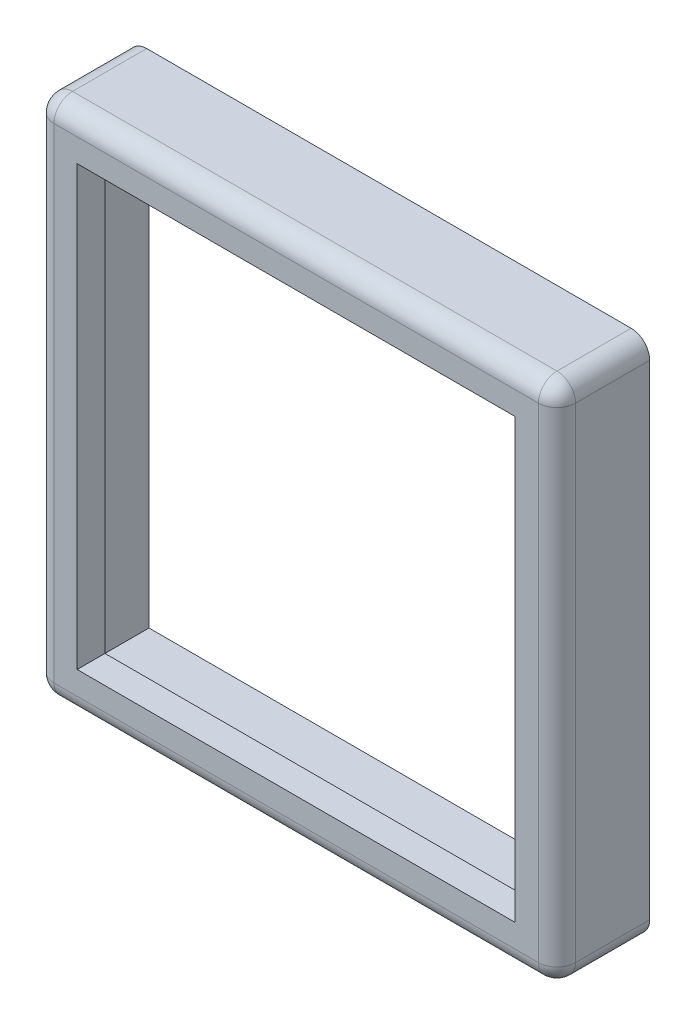
ISO-10303-21;
HEADER;
FILE_DESCRIPTION(('STEP AP214'),'2;1');
FILE_NAME('part.step','',(''),(''),'','','');
FILE_SCHEMA(('AUTOMOTIVE_DESIGN { 1 0 10303 214 1 1 1 1 }'));
ENDSEC;
DATA;
#1=APPLICATION_CONTEXT('core data for automotive mechanical design processes');
#2=APPLICATION_PROTOCOL_DEFINITION('international standard','automotive_design',2000,#1);
#3=PRODUCT_CONTEXT('',#1,'mechanical');
#4=PRODUCT('Part','Part','',(#3));
#5=PRODUCT_RELATED_PRODUCT_CATEGORY('part','',(#4));
#6=PRODUCT_DEFINITION_FORMATION('','',#4);
#7=PRODUCT_DEFINITION_CONTEXT('part definition',#1,'design');
#8=PRODUCT_DEFINITION('design','',#6,#7);
#9=PRODUCT_DEFINITION_SHAPE('','',#8);
#10=(LENGTH_UNIT() NAMED_UNIT(*) SI_UNIT(.MILLI.,.METRE.));
#11=(NAMED_UNIT(*) PLANE_ANGLE_UNIT() SI_UNIT($,.RADIAN.));
#12=(NAMED_UNIT(*) SI_UNIT($,.STERADIAN.) SOLID_ANGLE_UNIT());
#13=UNCERTAINTY_MEASURE_WITH_UNIT(LENGTH_MEASURE(1.E-05),#10,'distance_accuracy_value','');
#14=(GEOMETRIC_REPRESENTATION_CONTEXT(3) GLOBAL_UNCERTAINTY_ASSIGNED_CONTEXT((#13)) GLOBAL_UNIT_ASSIGNED_CONTEXT((#10,
#11,#12)) REPRESENTATION_CONTEXT('',''));
#15=CARTESIAN_POINT('',(0.,0.,0.));
#16=DIRECTION('',(0.,0.,1.));
#17=DIRECTION('',(1.,0.,0.));
#18=AXIS2_PLACEMENT_3D('',#15,#16,#17);
#19=CARTESIAN_POINT('',(5.55624999999943,-113.506249999997,-2.53999999999976));
#20=DIRECTION('',(0.,-1.,0.));
#21=DIRECTION('',(0.,0.,-1.));
#22=AXIS2_PLACEMENT_3D('',#19,#20,#21);
#23=PLANE('',#22);
#24=DIRECTION('',(1.,0.,0.));
#25=VECTOR('',#24,1.);
#26=CARTESIAN_POINT('',(5.55624999999943,-113.506249999997,-0.507999999999953));
#27=LINE('',#26,#25);
#28=CARTESIAN_POINT('',(19.3357499999994,-113.506249999997,-0.507999999999953));
#29=VERTEX_POINT('',#28);
#30=CARTESIAN_POINT('',(6.06424999999944,-113.506249999997,-0.507999999999953));
#31=VERTEX_POINT('',#30);
#32=EDGE_CURVE('E264',#29,#31,#27,.F.);
#33=ORIENTED_EDGE('',*,*,#32,.T.);
#34=DIRECTION('',(0.,0.,1.));
#35=VECTOR('',#34,1.);
#36=CARTESIAN_POINT('',(6.06424999999944,-113.506249999997,-2.53999999999976));
#37=LINE('',#36,#35);
#38=CARTESIAN_POINT('',(6.06424999999944,-113.506249999997,-2.53999999999976));
#39=VERTEX_POINT('',#38);
#40=EDGE_CURVE('E267',#31,#39,#37,.F.);
#41=ORIENTED_EDGE('',*,*,#40,.T.);
#42=DIRECTION('',(1.,0.,0.));
#43=VECTOR('',#42,1.);
#44=CARTESIAN_POINT('',(5.55624999999943,-113.506249999997,-2.53999999999976));
#45=LINE('',#44,#43);
#46=CARTESIAN_POINT('',(19.3357499999994,-113.506249999997,-2.53999999999976));
#47=VERTEX_POINT('',#46);
#48=EDGE_CURVE('E234',#39,#47,#45,.T.);
#49=ORIENTED_EDGE('',*,*,#48,.T.);
#50=DIRECTION('',(0.,0.,1.));
#51=VECTOR('',#50,1.);
#52=CARTESIAN_POINT('',(19.3357499999994,-113.506249999997,-2.53999999999976));
#53=LINE('',#52,#51);
#54=EDGE_CURVE('E262',#47,#29,#53,.T.);
#55=ORIENTED_EDGE('',*,*,#54,.T.);
#56=EDGE_LOOP('',(#33,#41,#49,#55));
#57=FACE_BOUND('',#56,.T.);
#58=ADVANCED_FACE('F44',(#57),#23,.T.);
#59=CARTESIAN_POINT('',(5.55624999999943,-99.2187499999968,-2.53999999999976));
#60=DIRECTION('',(-1.,0.,0.));
#61=DIRECTION('',(0.,-1.,0.));
#62=AXIS2_PLACEMENT_3D('',#59,#60,#61);
#63=PLANE('',#62);
#64=DIRECTION('',(0.,-1.,0.));
#65=VECTOR('',#64,1.);
#66=CARTESIAN_POINT('',(5.55624999999943,-99.2187499999968,-0.507999999999065));
#67=LINE('',#66,#65);
#68=CARTESIAN_POINT('',(5.55624999999943,-112.998249999998,-0.507999999997288));
#69=VERTEX_POINT('',#68);
#70=CARTESIAN_POINT('',(5.55624999999943,-99.7267499999968,-0.507999999999953));
#71=VERTEX_POINT('',#70);
#72=EDGE_CURVE('E271',#69,#71,#67,.F.);
#73=ORIENTED_EDGE('',*,*,#72,.T.);
#74=DIRECTION('',(0.,0.,1.));
#75=VECTOR('',#74,1.);
#76=CARTESIAN_POINT('',(5.55624999999943,-99.7267499999968,-2.53999999999976));
#77=LINE('',#76,#75);
#78=CARTESIAN_POINT('',(5.55624999999943,-99.7267499999968,-2.53999999999976));
#79=VERTEX_POINT('',#78);
#80=EDGE_CURVE('E273',#71,#79,#77,.F.);
#81=ORIENTED_EDGE('',*,*,#80,.T.);
#82=DIRECTION('',(0.,-1.,0.));
#83=VECTOR('',#82,1.);
#84=CARTESIAN_POINT('',(5.55624999999943,-99.2187499999968,-2.53999999999976));
#85=LINE('',#84,#83);
#86=CARTESIAN_POINT('',(5.55624999999943,-112.998249999996,-2.54000000000243));
#87=VERTEX_POINT('',#86);
#88=EDGE_CURVE('E247',#79,#87,#85,.T.);
#89=ORIENTED_EDGE('',*,*,#88,.T.);
#90=DIRECTION('',(0.,0.,1.));
#91=VECTOR('',#90,1.);
#92=CARTESIAN_POINT('',(5.55624999999943,-112.998249999996,-2.54000000000243));
#93=LINE('',#92,#91);
#94=EDGE_CURVE('E269',#87,#69,#93,.T.);
#95=ORIENTED_EDGE('',*,*,#94,.T.);
#96=EDGE_LOOP('',(#73,#81,#89,#95));
#97=FACE_BOUND('',#96,.T.);
#98=ADVANCED_FACE('F346',(#97),#63,.T.);
#99=CARTESIAN_POINT('',(19.8437499999994,-99.2187499999968,-2.53999999999976));
#100=DIRECTION('',(0.,1.,0.));
#101=DIRECTION('',(0.,0.,1.));
#102=AXIS2_PLACEMENT_3D('',#99,#100,#101);
#103=PLANE('',#102);
#104=DIRECTION('',(-1.,0.,0.));
#105=VECTOR('',#104,1.);
#106=CARTESIAN_POINT('',(19.8437499999994,-99.2187499999968,-0.507999999999953));
#107=LINE('',#106,#105);
#108=CARTESIAN_POINT('',(6.06424999999944,-99.2187499999968,-0.507999999999065));
#109=VERTEX_POINT('',#108);
#110=CARTESIAN_POINT('',(19.3357499999994,-99.2187499999968,-0.507999999999953));
#111=VERTEX_POINT('',#110);
#112=EDGE_CURVE('E277',#109,#111,#107,.F.);
#113=ORIENTED_EDGE('',*,*,#112,.T.);
#114=DIRECTION('',(0.,0.,1.));
#115=VECTOR('',#114,1.);
#116=CARTESIAN_POINT('',(19.3357499999994,-99.2187499999968,-2.53999999999976));
#117=LINE('',#116,#115);
#118=CARTESIAN_POINT('',(19.3357499999994,-99.2187499999968,-2.53999999999976));
#119=VERTEX_POINT('',#118);
#120=EDGE_CURVE('E279',#111,#119,#117,.F.);
#121=ORIENTED_EDGE('',*,*,#120,.T.);
#122=DIRECTION('',(-1.,0.,0.));
#123=VECTOR('',#122,1.);
#124=CARTESIAN_POINT('',(19.8437499999994,-99.2187499999968,-2.53999999999976));
#125=LINE('',#124,#123);
#126=CARTESIAN_POINT('',(6.06424999999944,-99.2187499999968,-2.53999999999976));
#127=VERTEX_POINT('',#126);
#128=EDGE_CURVE('E244',#119,#127,#125,.T.);
#129=ORIENTED_EDGE('',*,*,#128,.T.);
#130=DIRECTION('',(0.,0.,1.));
#131=VECTOR('',#130,1.);
#132=CARTESIAN_POINT('',(6.06424999999944,-99.2187499999968,-2.53999999999976));
#133=LINE('',#132,#131);
#134=EDGE_CURVE('E275',#127,#109,#133,.T.);
#135=ORIENTED_EDGE('',*,*,#134,.T.);
#136=EDGE_LOOP('',(#113,#121,#129,#135));
#137=FACE_BOUND('',#136,.T.);
#138=ADVANCED_FACE('F352',(#137),#103,.T.);
#139=CARTESIAN_POINT('',(19.8437499999994,-113.506249999997,-2.53999999999976));
#140=DIRECTION('',(1.,0.,0.));
#141=DIRECTION('',(0.,1.,0.));
#142=AXIS2_PLACEMENT_3D('',#139,#140,#141);
#143=PLANE('',#142);
#144=DIRECTION('',(0.,1.,0.));
#145=VECTOR('',#144,1.);
#146=CARTESIAN_POINT('',(19.8437499999994,-113.506249999997,-2.53999999999976));
#147=LINE('',#146,#145);
#148=CARTESIAN_POINT('',(19.8437499999994,-112.998249999997,-2.54000000000243));
#149=VERTEX_POINT('',#148);
#150=CARTESIAN_POINT('',(19.8437499999994,-99.7267499999968,-2.54000000000243));
#151=VERTEX_POINT('',#150);
#152=EDGE_CURVE('E242',#149,#151,#147,.T.);
#153=ORIENTED_EDGE('',*,*,#152,.T.);
#154=DIRECTION('',(0.,0.,1.));
#155=VECTOR('',#154,1.);
#156=CARTESIAN_POINT('',(19.8437499999994,-99.7267499999968,-2.54000000000243));
#157=LINE('',#156,#155);
#158=CARTESIAN_POINT('',(19.8437499999994,-99.7267499999968,-0.507999999999953));
#159=VERTEX_POINT('',#158);
#160=EDGE_CURVE('E61',#151,#159,#157,.T.);
#161=ORIENTED_EDGE('',*,*,#160,.T.);
#162=DIRECTION('',(0.,1.,0.));
#163=VECTOR('',#162,1.);
#164=CARTESIAN_POINT('',(19.8437499999994,-113.506249999997,-0.507999999999953));
#165=LINE('',#164,#163);
#166=CARTESIAN_POINT('',(19.8437499999994,-112.998249999997,-0.507999999998177));
#167=VERTEX_POINT('',#166);
#168=EDGE_CURVE('E66',#159,#167,#165,.F.);
#169=ORIENTED_EDGE('',*,*,#168,.T.);
#170=DIRECTION('',(0.,0.,1.));
#171=VECTOR('',#170,1.);
#172=CARTESIAN_POINT('',(19.8437499999994,-112.998249999997,-2.54000000000243));
#173=LINE('',#172,#171);
#174=EDGE_CURVE('E281',#167,#149,#173,.F.);
#175=ORIENTED_EDGE('',*,*,#174,.T.);
#176=EDGE_LOOP('',(#153,#161,#169,#175));
#177=FACE_BOUND('',#176,.T.);
#178=ADVANCED_FACE('F357',(#177),#143,.T.);
#179=CARTESIAN_POINT('',(0.,1.33226762955019E-12,-2.53999999999532));
#180=DIRECTION('',(0.,0.,1.));
#181=DIRECTION('',(1.,0.,0.));
#182=AXIS2_PLACEMENT_3D('',#179,#180,#181);
#183=PLANE('',#182);
#184=DIRECTION('',(0.,1.,0.));
#185=VECTOR('',#184,1.);
#186=CARTESIAN_POINT('',(6.12774999999943,-99.7902499999981,-2.53999999999976));
#187=LINE('',#186,#185);
#188=CARTESIAN_POINT('',(6.12774999999943,-112.934749999997,-2.53999999999976));
#189=VERTEX_POINT('',#188);
#190=CARTESIAN_POINT('',(6.12774999999943,-99.7902499999981,-2.53999999999976));
#191=VERTEX_POINT('',#190);
#192=EDGE_CURVE('E195',#189,#191,#187,.T.);
#193=ORIENTED_EDGE('',*,*,#192,.F.);
#194=DIRECTION('',(-1.,0.,0.));
#195=VECTOR('',#194,1.);
#196=CARTESIAN_POINT('',(19.2722499999994,-112.934749999997,-2.53999999999976));
#197=LINE('',#196,#195);
#198=CARTESIAN_POINT('',(19.2722499999994,-112.934749999997,-2.53999999999976));
#199=VERTEX_POINT('',#198);
#200=EDGE_CURVE('E186',#199,#189,#197,.T.);
#201=ORIENTED_EDGE('',*,*,#200,.F.);
#202=DIRECTION('',(0.,-1.,0.));
#203=VECTOR('',#202,1.);
#204=CARTESIAN_POINT('',(19.2722499999994,-99.7902499999981,-2.53999999999976));
#205=LINE('',#204,#203);
#206=CARTESIAN_POINT('',(19.2722499999994,-99.7902499999981,-2.53999999999976));
#207=VERTEX_POINT('',#206);
#208=EDGE_CURVE('E199',#207,#199,#205,.T.);
#209=ORIENTED_EDGE('',*,*,#208,.F.);
#210=DIRECTION('',(1.,0.,0.));
#211=VECTOR('',#210,1.);
#212=CARTESIAN_POINT('',(19.2722499999994,-99.7902499999981,-2.53999999999976));
#213=LINE('',#212,#211);
#214=EDGE_CURVE('E193',#191,#207,#213,.T.);
#215=ORIENTED_EDGE('',*,*,#214,.F.);
#216=EDGE_LOOP('',(#193,#201,#209,#215));
#217=FACE_BOUND('',#216,.T.);
#218=ORIENTED_EDGE('',*,*,#128,.F.);
#219=CARTESIAN_POINT('',(19.3357499999994,-99.7267499999968,-2.54000000000243));
#220=DIRECTION('',(0.,0.,1.));
#221=DIRECTION('',(1.,0.,0.));
#222=AXIS2_PLACEMENT_3D('',#219,#220,#221);
#223=CIRCLE('',#222,0.508);
#224=EDGE_CURVE('E12',#119,#151,#223,.F.);
#225=ORIENTED_EDGE('',*,*,#224,.T.);
#226=ORIENTED_EDGE('',*,*,#152,.F.);
#227=CARTESIAN_POINT('',(19.3357499999994,-112.998249999997,-2.54000000000243));
#228=DIRECTION('',(0.,0.,1.));
#229=DIRECTION('',(1.,0.,0.));
#230=AXIS2_PLACEMENT_3D('',#227,#228,#229);
#231=CIRCLE('',#230,0.508);
#232=EDGE_CURVE('E285',#149,#47,#231,.F.);
#233=ORIENTED_EDGE('',*,*,#232,.T.);
#234=ORIENTED_EDGE('',*,*,#48,.F.);
#235=CARTESIAN_POINT('',(6.06424999999944,-112.998249999996,-2.54000000000243));
#236=DIRECTION('',(0.,0.,1.));
#237=DIRECTION('',(1.,0.,0.));
#238=AXIS2_PLACEMENT_3D('',#235,#236,#237);
#239=CIRCLE('',#238,0.508);
#240=EDGE_CURVE('E287',#39,#87,#239,.F.);
#241=ORIENTED_EDGE('',*,*,#240,.T.);
#242=ORIENTED_EDGE('',*,*,#88,.F.);
#243=CARTESIAN_POINT('',(6.06424999999944,-99.7267499999968,-2.53999999999976));
#244=DIRECTION('',(0.,0.,1.));
#245=DIRECTION('',(1.,0.,0.));
#246=AXIS2_PLACEMENT_3D('',#243,#244,#245);
#247=CIRCLE('',#246,0.508);
#248=EDGE_CURVE('E53',#79,#127,#247,.F.);
#249=ORIENTED_EDGE('',*,*,#248,.T.);
#250=EDGE_LOOP('',(#218,#225,#226,#233,#234,#241,#242,#249));
#251=FACE_BOUND('',#250,.T.);
#252=ADVANCED_FACE('F330',(#217,#251),#183,.F.);
#253=CARTESIAN_POINT('',(0.,0.,0.));
#254=DIRECTION('',(0.,0.,1.));
#255=DIRECTION('',(1.,0.,0.));
#256=AXIS2_PLACEMENT_3D('',#253,#254,#255);
#257=PLANE('',#256);
#258=DIRECTION('',(0.,-1.,0.));
#259=VECTOR('',#258,1.);
#260=CARTESIAN_POINT('',(6.06424999999944,0.,0.));
#261=LINE('',#260,#259);
#262=CARTESIAN_POINT('',(6.06424999999944,-99.726749999999,1.77635683940025E-12));
#263=VERTEX_POINT('',#262);
#264=CARTESIAN_POINT('',(6.06424999999944,-112.998249999997,0.));
#265=VERTEX_POINT('',#264);
#266=EDGE_CURVE('E257',#263,#265,#261,.T.);
#267=ORIENTED_EDGE('',*,*,#266,.T.);
#268=DIRECTION('',(1.,0.,0.));
#269=VECTOR('',#268,1.);
#270=CARTESIAN_POINT('',(0.,-112.998249999997,0.));
#271=LINE('',#270,#269);
#272=CARTESIAN_POINT('',(19.3357499999994,-112.998249999997,0.));
#273=VERTEX_POINT('',#272);
#274=EDGE_CURVE('E259',#265,#273,#271,.T.);
#275=ORIENTED_EDGE('',*,*,#274,.T.);
#276=DIRECTION('',(0.,1.,0.));
#277=VECTOR('',#276,1.);
#278=CARTESIAN_POINT('',(19.3357499999994,0.,0.));
#279=LINE('',#278,#277);
#280=CARTESIAN_POINT('',(19.3357499999994,-99.7267499999985,8.88178419700125E-13));
#281=VERTEX_POINT('',#280);
#282=EDGE_CURVE('E253',#273,#281,#279,.T.);
#283=ORIENTED_EDGE('',*,*,#282,.T.);
#284=DIRECTION('',(-1.,0.,0.));
#285=VECTOR('',#284,1.);
#286=CARTESIAN_POINT('',(0.,-99.726749999999,1.77635683940025E-12));
#287=LINE('',#286,#285);
#288=EDGE_CURVE('E255',#281,#263,#287,.T.);
#289=ORIENTED_EDGE('',*,*,#288,.T.);
#290=EDGE_LOOP('',(#267,#275,#283,#289));
#291=FACE_BOUND('',#290,.T.);
#292=DIRECTION('',(0.,1.,0.));
#293=VECTOR('',#292,1.);
#294=CARTESIAN_POINT('',(18.7007499999994,-112.363249999997,0.));
#295=LINE('',#294,#293);
#296=CARTESIAN_POINT('',(18.7007499999994,-112.363249999997,0.));
#297=VERTEX_POINT('',#296);
#298=CARTESIAN_POINT('',(18.7007499999994,-100.361749999997,0.));
#299=VERTEX_POINT('',#298);
#300=EDGE_CURVE('E219',#297,#299,#295,.T.);
#301=ORIENTED_EDGE('',*,*,#300,.F.);
#302=DIRECTION('',(1.,0.,0.));
#303=VECTOR('',#302,1.);
#304=CARTESIAN_POINT('',(6.69924999999943,-112.363249999997,0.));
#305=LINE('',#304,#303);
#306=CARTESIAN_POINT('',(6.69924999999943,-112.363249999997,0.));
#307=VERTEX_POINT('',#306);
#308=EDGE_CURVE('E228',#307,#297,#305,.T.);
#309=ORIENTED_EDGE('',*,*,#308,.F.);
#310=DIRECTION('',(0.,-1.,0.));
#311=VECTOR('',#310,1.);
#312=CARTESIAN_POINT('',(6.69924999999943,-100.361749999997,0.));
#313=LINE('',#312,#311);
#314=CARTESIAN_POINT('',(6.69924999999943,-100.361749999997,0.));
#315=VERTEX_POINT('',#314);
#316=EDGE_CURVE('E225',#315,#307,#313,.T.);
#317=ORIENTED_EDGE('',*,*,#316,.F.);
#318=DIRECTION('',(-1.,0.,0.));
#319=VECTOR('',#318,1.);
#320=CARTESIAN_POINT('',(18.7007499999994,-100.361749999997,0.));
#321=LINE('',#320,#319);
#322=EDGE_CURVE('E222',#299,#315,#321,.T.);
#323=ORIENTED_EDGE('',*,*,#322,.F.);
#324=EDGE_LOOP('',(#301,#309,#317,#323));
#325=FACE_BOUND('',#324,.T.);
#326=ADVANCED_FACE('F426',(#291,#325),#257,.T.);
#327=CARTESIAN_POINT('',(18.7007499999994,-112.363249999997,-2.53999999999799));
#328=DIRECTION('',(1.,0.,0.));
#329=DIRECTION('',(0.,1.,0.));
#330=AXIS2_PLACEMENT_3D('',#327,#328,#329);
#331=PLANE('',#330);
#332=DIRECTION('',(0.,0.,1.));
#333=VECTOR('',#332,1.);
#334=CARTESIAN_POINT('',(18.7007499999994,-100.361749999997,-2.53999999999976));
#335=LINE('',#334,#333);
#336=CARTESIAN_POINT('',(18.7007499999994,-100.361749999997,-0.762000000000818));
#337=VERTEX_POINT('',#336);
#338=EDGE_CURVE('E231',#337,#299,#335,.T.);
#339=ORIENTED_EDGE('',*,*,#338,.F.);
#340=DIRECTION('',(0.,-1.,0.));
#341=VECTOR('',#340,1.);
#342=CARTESIAN_POINT('',(18.7007499999994,-112.363249999997,-0.762000000002594));
#343=LINE('',#342,#341);
#344=CARTESIAN_POINT('',(18.7007499999994,-112.363249999997,-0.762000000002594));
#345=VERTEX_POINT('',#344);
#346=EDGE_CURVE('E216',#337,#345,#343,.T.);
#347=ORIENTED_EDGE('',*,*,#346,.T.);
#348=DIRECTION('',(0.,0.,1.));
#349=VECTOR('',#348,1.);
#350=CARTESIAN_POINT('',(18.7007499999994,-112.363249999997,-2.53999999999799));
#351=LINE('',#350,#349);
#352=EDGE_CURVE('E232',#345,#297,#351,.T.);
#353=ORIENTED_EDGE('',*,*,#352,.T.);
#354=ORIENTED_EDGE('',*,*,#300,.T.);
#355=EDGE_LOOP('',(#339,#347,#353,#354));
#356=FACE_BOUND('',#355,.T.);
#357=ADVANCED_FACE('F444',(#356),#331,.F.);
#358=CARTESIAN_POINT('',(6.69924999999943,-112.363249999997,-2.53999999999799));
#359=DIRECTION('',(0.,-1.,0.));
#360=DIRECTION('',(0.,0.,-1.));
#361=AXIS2_PLACEMENT_3D('',#358,#359,#360);
#362=PLANE('',#361);
#363=ORIENTED_EDGE('',*,*,#352,.F.);
#364=DIRECTION('',(-1.,0.,0.));
#365=VECTOR('',#364,1.);
#366=CARTESIAN_POINT('',(6.69924999999943,-112.363249999997,-0.762000000002594));
#367=LINE('',#366,#365);
#368=CARTESIAN_POINT('',(6.69924999999943,-112.363249999997,-0.762000000002594));
#369=VERTEX_POINT('',#368);
#370=EDGE_CURVE('E213',#345,#369,#367,.T.);
#371=ORIENTED_EDGE('',*,*,#370,.T.);
#372=DIRECTION('',(0.,0.,1.));
#373=VECTOR('',#372,1.);
#374=CARTESIAN_POINT('',(6.69924999999943,-112.363249999997,-2.53999999999799));
#375=LINE('',#374,#373);
#376=EDGE_CURVE('E235',#369,#307,#375,.T.);
#377=ORIENTED_EDGE('',*,*,#376,.T.);
#378=ORIENTED_EDGE('',*,*,#308,.T.);
#379=EDGE_LOOP('',(#363,#371,#377,#378));
#380=FACE_BOUND('',#379,.T.);
#381=ADVANCED_FACE('F448',(#380),#362,.F.);
#382=CARTESIAN_POINT('',(6.69924999999943,-100.361749999997,-2.53999999999976));
#383=DIRECTION('',(-1.,0.,0.));
#384=DIRECTION('',(0.,0.,1.));
#385=AXIS2_PLACEMENT_3D('',#382,#383,#384);
#386=PLANE('',#385);
#387=ORIENTED_EDGE('',*,*,#376,.F.);
#388=DIRECTION('',(0.,1.,0.));
#389=VECTOR('',#388,1.);
#390=CARTESIAN_POINT('',(6.69924999999943,-100.361749999997,-0.762000000000818));
#391=LINE('',#390,#389);
#392=CARTESIAN_POINT('',(6.69924999999943,-100.361749999997,-0.762000000000818));
#393=VERTEX_POINT('',#392);
#394=EDGE_CURVE('E210',#369,#393,#391,.T.);
#395=ORIENTED_EDGE('',*,*,#394,.T.);
#396=DIRECTION('',(0.,0.,1.));
#397=VECTOR('',#396,1.);
#398=CARTESIAN_POINT('',(6.69924999999943,-100.361749999997,-2.53999999999976));
#399=LINE('',#398,#397);
#400=EDGE_CURVE('E237',#393,#315,#399,.T.);
#401=ORIENTED_EDGE('',*,*,#400,.T.);
#402=ORIENTED_EDGE('',*,*,#316,.T.);
#403=EDGE_LOOP('',(#387,#395,#401,#402));
#404=FACE_BOUND('',#403,.T.);
#405=ADVANCED_FACE('F453',(#404),#386,.F.);
#406=CARTESIAN_POINT('',(18.7007499999994,-100.361749999997,-2.53999999999976));
#407=DIRECTION('',(0.,1.,0.));
#408=DIRECTION('',(0.,0.,1.));
#409=AXIS2_PLACEMENT_3D('',#406,#407,#408);
#410=PLANE('',#409);
#411=ORIENTED_EDGE('',*,*,#400,.F.);
#412=DIRECTION('',(1.,0.,0.));
#413=VECTOR('',#412,1.);
#414=CARTESIAN_POINT('',(18.7007499999994,-100.361749999997,-0.762000000000818));
#415=LINE('',#414,#413);
#416=EDGE_CURVE('E250',#393,#337,#415,.T.);
#417=ORIENTED_EDGE('',*,*,#416,.T.);
#418=ORIENTED_EDGE('',*,*,#338,.T.);
#419=ORIENTED_EDGE('',*,*,#322,.T.);
#420=EDGE_LOOP('',(#411,#417,#418,#419));
#421=FACE_BOUND('',#420,.T.);
#422=ADVANCED_FACE('F450',(#421),#410,.F.);
#423=CARTESIAN_POINT('',(0.,4.44089209850063E-13,-0.761999999999929));
#424=DIRECTION('',(0.,0.,1.));
#425=DIRECTION('',(1.,0.,0.));
#426=AXIS2_PLACEMENT_3D('',#423,#424,#425);
#427=PLANE('',#426);
#428=DIRECTION('',(0.,-1.,0.));
#429=VECTOR('',#428,1.);
#430=CARTESIAN_POINT('',(19.2722499999994,-99.7902499999972,-0.761999999999929));
#431=LINE('',#430,#429);
#432=CARTESIAN_POINT('',(19.2722499999994,-99.7902499999972,-0.761999999999929));
#433=VERTEX_POINT('',#432);
#434=CARTESIAN_POINT('',(19.2722499999994,-112.934749999997,-0.761999999999929));
#435=VERTEX_POINT('',#434);
#436=EDGE_CURVE('E191',#433,#435,#431,.T.);
#437=ORIENTED_EDGE('',*,*,#436,.T.);
#438=DIRECTION('',(-1.,0.,0.));
#439=VECTOR('',#438,1.);
#440=CARTESIAN_POINT('',(19.2722499999994,-112.934749999997,-0.761999999999929));
#441=LINE('',#440,#439);
#442=CARTESIAN_POINT('',(6.12774999999943,-112.934749999997,-0.761999999999929));
#443=VERTEX_POINT('',#442);
#444=EDGE_CURVE('E183',#435,#443,#441,.T.);
#445=ORIENTED_EDGE('',*,*,#444,.T.);
#446=DIRECTION('',(0.,1.,0.));
#447=VECTOR('',#446,1.);
#448=CARTESIAN_POINT('',(6.12774999999943,-99.7902499999972,-0.761999999999929));
#449=LINE('',#448,#447);
#450=CARTESIAN_POINT('',(6.12774999999943,-99.7902499999972,-0.761999999999929));
#451=VERTEX_POINT('',#450);
#452=EDGE_CURVE('E170',#443,#451,#449,.T.);
#453=ORIENTED_EDGE('',*,*,#452,.T.);
#454=DIRECTION('',(1.,0.,0.));
#455=VECTOR('',#454,1.);
#456=CARTESIAN_POINT('',(19.2722499999994,-99.7902499999972,-0.761999999999929));
#457=LINE('',#456,#455);
#458=EDGE_CURVE('E204',#451,#433,#457,.T.);
#459=ORIENTED_EDGE('',*,*,#458,.T.);
#460=EDGE_LOOP('',(#437,#445,#453,#459));
#461=FACE_BOUND('',#460,.T.);
#462=ORIENTED_EDGE('',*,*,#416,.F.);
#463=ORIENTED_EDGE('',*,*,#394,.F.);
#464=ORIENTED_EDGE('',*,*,#370,.F.);
#465=ORIENTED_EDGE('',*,*,#346,.F.);
#466=EDGE_LOOP('',(#462,#463,#464,#465));
#467=FACE_BOUND('',#466,.T.);
#468=ADVANCED_FACE('F189',(#461,#467),#427,.F.);
#469=CARTESIAN_POINT('',(19.2722499999994,-112.934749999997,18.5891301706098));
#470=DIRECTION('',(0.,-1.,0.));
#471=DIRECTION('',(0.,0.,-1.));
#472=AXIS2_PLACEMENT_3D('',#469,#470,#471);
#473=PLANE('',#472);
#474=DIRECTION('',(0.,0.,-1.));
#475=VECTOR('',#474,1.);
#476=CARTESIAN_POINT('',(19.2722499999994,-112.934749999997,18.5891301706098));
#477=LINE('',#476,#475);
#478=EDGE_CURVE('E202',#435,#199,#477,.T.);
#479=ORIENTED_EDGE('',*,*,#478,.T.);
#480=ORIENTED_EDGE('',*,*,#200,.T.);
#481=DIRECTION('',(0.,0.,-1.));
#482=VECTOR('',#481,1.);
#483=CARTESIAN_POINT('',(6.12774999999943,-112.934749999997,18.5891301706134));
#484=LINE('',#483,#482);
#485=EDGE_CURVE('E174',#443,#189,#484,.T.);
#486=ORIENTED_EDGE('',*,*,#485,.F.);
#487=ORIENTED_EDGE('',*,*,#444,.F.);
#488=EDGE_LOOP('',(#479,#480,#486,#487));
#489=FACE_BOUND('',#488,.T.);
#490=ADVANCED_FACE('F182',(#489),#473,.F.);
#491=CARTESIAN_POINT('',(6.12774999999943,-99.7902499999972,18.5891301706116));
#492=DIRECTION('',(-1.,0.,0.));
#493=DIRECTION('',(0.,0.,1.));
#494=AXIS2_PLACEMENT_3D('',#491,#492,#493);
#495=PLANE('',#494);
#496=ORIENTED_EDGE('',*,*,#485,.T.);
#497=ORIENTED_EDGE('',*,*,#192,.T.);
#498=DIRECTION('',(0.,0.,-1.));
#499=VECTOR('',#498,1.);
#500=CARTESIAN_POINT('',(6.12774999999943,-99.7902499999972,18.5891301706116));
#501=LINE('',#500,#499);
#502=EDGE_CURVE('E176',#451,#191,#501,.T.);
#503=ORIENTED_EDGE('',*,*,#502,.F.);
#504=ORIENTED_EDGE('',*,*,#452,.F.);
#505=EDGE_LOOP('',(#496,#497,#503,#504));
#506=FACE_BOUND('',#505,.T.);
#507=ADVANCED_FACE('F172',(#506),#495,.F.);
#508=CARTESIAN_POINT('',(19.2722499999994,-99.7902499999972,18.5891301706125));
#509=DIRECTION('',(0.,1.,0.));
#510=DIRECTION('',(0.,0.,1.));
#511=AXIS2_PLACEMENT_3D('',#508,#509,#510);
#512=PLANE('',#511);
#513=ORIENTED_EDGE('',*,*,#502,.T.);
#514=ORIENTED_EDGE('',*,*,#214,.T.);
#515=DIRECTION('',(0.,0.,-1.));
#516=VECTOR('',#515,1.);
#517=CARTESIAN_POINT('',(19.2722499999994,-99.7902499999972,18.5891301706125));
#518=LINE('',#517,#516);
#519=EDGE_CURVE('E203',#433,#207,#518,.T.);
#520=ORIENTED_EDGE('',*,*,#519,.F.);
#521=ORIENTED_EDGE('',*,*,#458,.F.);
#522=EDGE_LOOP('',(#513,#514,#520,#521));
#523=FACE_BOUND('',#522,.T.);
#524=ADVANCED_FACE('F334',(#523),#512,.F.);
#525=CARTESIAN_POINT('',(19.2722499999994,-99.7902499999972,18.5891301706125));
#526=DIRECTION('',(1.,0.,0.));
#527=DIRECTION('',(0.,0.,-1.));
#528=AXIS2_PLACEMENT_3D('',#525,#526,#527);
#529=PLANE('',#528);
#530=ORIENTED_EDGE('',*,*,#519,.T.);
#531=ORIENTED_EDGE('',*,*,#208,.T.);
#532=ORIENTED_EDGE('',*,*,#478,.F.);
#533=ORIENTED_EDGE('',*,*,#436,.F.);
#534=EDGE_LOOP('',(#530,#531,#532,#533));
#535=FACE_BOUND('',#534,.T.);
#536=ADVANCED_FACE('F335',(#535),#529,.F.);
#537=CARTESIAN_POINT('',(6.06424999999944,-99.7267499999968,-2.53999999999976));
#538=DIRECTION('',(0.,0.,1.));
#539=DIRECTION('',(1.,0.,0.));
#540=AXIS2_PLACEMENT_3D('',#537,#538,#539);
#541=CYLINDRICAL_SURFACE('',#540,0.508);
#542=ORIENTED_EDGE('',*,*,#248,.F.);
#543=ORIENTED_EDGE('',*,*,#80,.F.);
#544=CARTESIAN_POINT('',(6.06424999999944,-99.7267499999968,-0.507999999999953));
#545=DIRECTION('',(0.,0.,1.));
#546=DIRECTION('',(1.,0.,0.));
#547=AXIS2_PLACEMENT_3D('',#544,#545,#546);
#548=CIRCLE('',#547,0.508);
#549=EDGE_CURVE('E48',#109,#71,#548,.T.);
#550=ORIENTED_EDGE('',*,*,#549,.F.);
#551=ORIENTED_EDGE('',*,*,#134,.F.);
#552=EDGE_LOOP('',(#542,#543,#550,#551));
#553=FACE_BOUND('',#552,.T.);
#554=ADVANCED_FACE('F46',(#553),#541,.T.);
#555=CARTESIAN_POINT('',(0.,-99.7267499999968,-0.507999999999953));
#556=DIRECTION('',(-1.,0.,0.));
#557=DIRECTION('',(0.,0.,1.));
#558=AXIS2_PLACEMENT_3D('',#555,#556,#557);
#559=CYLINDRICAL_SURFACE('',#558,0.508);
#560=CARTESIAN_POINT('',(19.3357499999994,-99.7267499999968,-0.507999999999953));
#561=DIRECTION('',(1.,0.,0.));
#562=DIRECTION('',(0.,0.,-1.));
#563=AXIS2_PLACEMENT_3D('',#560,#561,#562);
#564=CIRCLE('',#563,0.508);
#565=EDGE_CURVE('E315',#111,#281,#564,.T.);
#566=ORIENTED_EDGE('',*,*,#565,.F.);
#567=ORIENTED_EDGE('',*,*,#112,.F.);
#568=CARTESIAN_POINT('',(6.06424999999944,-99.7267499999968,-0.507999999999953));
#569=DIRECTION('',(-1.,0.,0.));
#570=DIRECTION('',(0.,0.,1.));
#571=AXIS2_PLACEMENT_3D('',#568,#569,#570);
#572=CIRCLE('',#571,0.508);
#573=EDGE_CURVE('E317',#263,#109,#572,.T.);
#574=ORIENTED_EDGE('',*,*,#573,.F.);
#575=ORIENTED_EDGE('',*,*,#288,.F.);
#576=EDGE_LOOP('',(#566,#567,#574,#575));
#577=FACE_BOUND('',#576,.T.);
#578=ADVANCED_FACE('F342',(#577),#559,.T.);
#579=CARTESIAN_POINT('',(19.3357499999994,-99.7267499999968,-2.54000000000243));
#580=DIRECTION('',(0.,0.,1.));
#581=DIRECTION('',(1.,0.,0.));
#582=AXIS2_PLACEMENT_3D('',#579,#580,#581);
#583=CYLINDRICAL_SURFACE('',#582,0.508);
#584=ORIENTED_EDGE('',*,*,#224,.F.);
#585=ORIENTED_EDGE('',*,*,#120,.F.);
#586=CARTESIAN_POINT('',(19.3357499999994,-99.7267499999968,-0.507999999999953));
#587=DIRECTION('',(0.,0.,1.));
#588=DIRECTION('',(1.,0.,0.));
#589=AXIS2_PLACEMENT_3D('',#586,#587,#588);
#590=CIRCLE('',#589,0.508);
#591=EDGE_CURVE('E312',#159,#111,#590,.T.);
#592=ORIENTED_EDGE('',*,*,#591,.F.);
#593=ORIENTED_EDGE('',*,*,#160,.F.);
#594=EDGE_LOOP('',(#584,#585,#592,#593));
#595=FACE_BOUND('',#594,.T.);
#596=ADVANCED_FACE('F394',(#595),#583,.T.);
#597=CARTESIAN_POINT('',(6.06424999999944,-99.7267499999968,-0.507999999999953));
#598=DIRECTION('',(0.,0.,1.));
#599=DIRECTION('',(1.,0.,0.));
#600=AXIS2_PLACEMENT_3D('',#597,#598,#599);
#601=SPHERICAL_SURFACE('',#600,0.508);
#602=ORIENTED_EDGE('',*,*,#573,.T.);
#603=ORIENTED_EDGE('',*,*,#549,.T.);
#604=CARTESIAN_POINT('',(6.06424999999944,-99.7267499999968,-0.507999999999953));
#605=DIRECTION('',(0.,1.,0.));
#606=DIRECTION('',(0.,0.,1.));
#607=AXIS2_PLACEMENT_3D('',#604,#605,#606);
#608=CIRCLE('',#607,0.508);
#609=EDGE_CURVE('E309',#263,#71,#608,.F.);
#610=ORIENTED_EDGE('',*,*,#609,.F.);
#611=EDGE_LOOP('',(#602,#603,#610));
#612=FACE_BOUND('',#611,.T.);
#613=ADVANCED_FACE('F390',(#612),#601,.T.);
#614=CARTESIAN_POINT('',(19.3357499999994,-99.7267499999968,-0.507999999999953));
#615=DIRECTION('',(0.,0.,1.));
#616=DIRECTION('',(1.,0.,0.));
#617=AXIS2_PLACEMENT_3D('',#614,#615,#616);
#618=SPHERICAL_SURFACE('',#617,0.508);
#619=ORIENTED_EDGE('',*,*,#591,.T.);
#620=ORIENTED_EDGE('',*,*,#565,.T.);
#621=CARTESIAN_POINT('',(19.3357499999994,-99.7267499999968,-0.507999999999953));
#622=DIRECTION('',(0.,1.,0.));
#623=DIRECTION('',(0.,0.,1.));
#624=AXIS2_PLACEMENT_3D('',#621,#622,#623);
#625=CIRCLE('',#624,0.508);
#626=EDGE_CURVE('E306',#159,#281,#625,.F.);
#627=ORIENTED_EDGE('',*,*,#626,.F.);
#628=EDGE_LOOP('',(#619,#620,#627));
#629=FACE_BOUND('',#628,.T.);
#630=ADVANCED_FACE('F386',(#629),#618,.T.);
#631=CARTESIAN_POINT('',(6.06424999999944,-112.998249999996,-2.54000000000243));
#632=DIRECTION('',(0.,0.,1.));
#633=DIRECTION('',(1.,0.,0.));
#634=AXIS2_PLACEMENT_3D('',#631,#632,#633);
#635=CYLINDRICAL_SURFACE('',#634,0.508);
#636=ORIENTED_EDGE('',*,*,#240,.F.);
#637=ORIENTED_EDGE('',*,*,#40,.F.);
#638=CARTESIAN_POINT('',(6.06424999999944,-112.998249999998,-0.507999999997288));
#639=DIRECTION('',(0.,0.,1.));
#640=DIRECTION('',(1.,0.,0.));
#641=AXIS2_PLACEMENT_3D('',#638,#639,#640);
#642=CIRCLE('',#641,0.508);
#643=EDGE_CURVE('E303',#69,#31,#642,.T.);
#644=ORIENTED_EDGE('',*,*,#643,.F.);
#645=ORIENTED_EDGE('',*,*,#94,.F.);
#646=EDGE_LOOP('',(#636,#637,#644,#645));
#647=FACE_BOUND('',#646,.T.);
#648=ADVANCED_FACE('F382',(#647),#635,.T.);
#649=CARTESIAN_POINT('',(6.06424999999944,2.22044604925031E-13,-0.507999999999065));
#650=DIRECTION('',(0.,-1.,0.));
#651=DIRECTION('',(1.,0.,0.));
#652=AXIS2_PLACEMENT_3D('',#649,#650,#651);
#653=CYLINDRICAL_SURFACE('',#652,0.508);
#654=ORIENTED_EDGE('',*,*,#609,.T.);
#655=ORIENTED_EDGE('',*,*,#72,.F.);
#656=CARTESIAN_POINT('',(6.06424999999944,-112.998249999998,-0.507999999997288));
#657=DIRECTION('',(0.,-1.,0.));
#658=DIRECTION('',(0.,0.,-1.));
#659=AXIS2_PLACEMENT_3D('',#656,#657,#658);
#660=CIRCLE('',#659,0.508);
#661=EDGE_CURVE('E300',#265,#69,#660,.T.);
#662=ORIENTED_EDGE('',*,*,#661,.F.);
#663=ORIENTED_EDGE('',*,*,#266,.F.);
#664=EDGE_LOOP('',(#654,#655,#662,#663));
#665=FACE_BOUND('',#664,.T.);
#666=ADVANCED_FACE('F378',(#665),#653,.T.);
#667=CARTESIAN_POINT('',(19.3357499999994,2.22044604925031E-13,-0.507999999999065));
#668=DIRECTION('',(0.,1.,0.));
#669=DIRECTION('',(-1.,0.,0.));
#670=AXIS2_PLACEMENT_3D('',#667,#668,#669);
#671=CYLINDRICAL_SURFACE('',#670,0.508);
#672=ORIENTED_EDGE('',*,*,#626,.T.);
#673=ORIENTED_EDGE('',*,*,#282,.F.);
#674=CARTESIAN_POINT('',(19.3357499999994,-112.998249999997,-0.507999999998177));
#675=DIRECTION('',(0.,-1.,0.));
#676=DIRECTION('',(0.,0.,-1.));
#677=AXIS2_PLACEMENT_3D('',#674,#675,#676);
#678=CIRCLE('',#677,0.508);
#679=EDGE_CURVE('E297',#167,#273,#678,.T.);
#680=ORIENTED_EDGE('',*,*,#679,.F.);
#681=ORIENTED_EDGE('',*,*,#168,.F.);
#682=EDGE_LOOP('',(#672,#673,#680,#681));
#683=FACE_BOUND('',#682,.T.);
#684=ADVANCED_FACE('F374',(#683),#671,.T.);
#685=CARTESIAN_POINT('',(19.3357499999994,-112.998249999997,-2.54000000000243));
#686=DIRECTION('',(0.,0.,1.));
#687=DIRECTION('',(1.,0.,0.));
#688=AXIS2_PLACEMENT_3D('',#685,#686,#687);
#689=CYLINDRICAL_SURFACE('',#688,0.508);
#690=ORIENTED_EDGE('',*,*,#232,.F.);
#691=ORIENTED_EDGE('',*,*,#174,.F.);
#692=CARTESIAN_POINT('',(19.3357499999994,-112.998249999997,-0.507999999998177));
#693=DIRECTION('',(0.,0.,1.));
#694=DIRECTION('',(1.,0.,0.));
#695=AXIS2_PLACEMENT_3D('',#692,#693,#694);
#696=CIRCLE('',#695,0.508);
#697=EDGE_CURVE('E294',#29,#167,#696,.T.);
#698=ORIENTED_EDGE('',*,*,#697,.F.);
#699=ORIENTED_EDGE('',*,*,#54,.F.);
#700=EDGE_LOOP('',(#690,#691,#698,#699));
#701=FACE_BOUND('',#700,.T.);
#702=ADVANCED_FACE('F370',(#701),#689,.T.);
#703=CARTESIAN_POINT('',(6.06424999999944,-112.998249999998,-0.507999999997288));
#704=DIRECTION('',(0.,0.,1.));
#705=DIRECTION('',(1.,0.,0.));
#706=AXIS2_PLACEMENT_3D('',#703,#704,#705);
#707=SPHERICAL_SURFACE('',#706,0.508);
#708=ORIENTED_EDGE('',*,*,#661,.T.);
#709=ORIENTED_EDGE('',*,*,#643,.T.);
#710=CARTESIAN_POINT('',(6.06424999999944,-112.998249999998,-0.507999999997288));
#711=DIRECTION('',(-1.,0.,0.));
#712=DIRECTION('',(0.,0.,1.));
#713=AXIS2_PLACEMENT_3D('',#710,#711,#712);
#714=CIRCLE('',#713,0.508);
#715=EDGE_CURVE('E292',#265,#31,#714,.F.);
#716=ORIENTED_EDGE('',*,*,#715,.F.);
#717=EDGE_LOOP('',(#708,#709,#716));
#718=FACE_BOUND('',#717,.T.);
#719=ADVANCED_FACE('F366',(#718),#707,.T.);
#720=CARTESIAN_POINT('',(19.3357499999994,-112.998249999997,-0.507999999998177));
#721=DIRECTION('',(0.,0.,1.));
#722=DIRECTION('',(1.,0.,0.));
#723=AXIS2_PLACEMENT_3D('',#720,#721,#722);
#724=SPHERICAL_SURFACE('',#723,0.508);
#725=ORIENTED_EDGE('',*,*,#697,.T.);
#726=ORIENTED_EDGE('',*,*,#679,.T.);
#727=CARTESIAN_POINT('',(19.3357499999994,-112.998249999997,-0.507999999998177));
#728=DIRECTION('',(1.,0.,0.));
#729=DIRECTION('',(0.,0.,-1.));
#730=AXIS2_PLACEMENT_3D('',#727,#728,#729);
#731=CIRCLE('',#730,0.508);
#732=EDGE_CURVE('E290',#29,#273,#731,.F.);
#733=ORIENTED_EDGE('',*,*,#732,.F.);
#734=EDGE_LOOP('',(#725,#726,#733));
#735=FACE_BOUND('',#734,.T.);
#736=ADVANCED_FACE('F362',(#735),#724,.T.);
#737=CARTESIAN_POINT('',(0.,-112.998249999998,-0.507999999997288));
#738=DIRECTION('',(1.,0.,0.));
#739=DIRECTION('',(0.,0.,-1.));
#740=AXIS2_PLACEMENT_3D('',#737,#738,#739);
#741=CYLINDRICAL_SURFACE('',#740,0.508);
#742=ORIENTED_EDGE('',*,*,#715,.T.);
#743=ORIENTED_EDGE('',*,*,#32,.F.);
#744=ORIENTED_EDGE('',*,*,#732,.T.);
#745=ORIENTED_EDGE('',*,*,#274,.F.);
#746=EDGE_LOOP('',(#742,#743,#744,#745));
#747=FACE_BOUND('',#746,.T.);
#748=ADVANCED_FACE('F359',(#747),#741,.T.);
#749=CLOSED_SHELL('',(#58,#98,#138,#178,#252,#326,#357,#381,#405,#422,#468,#490,#507,#524,#536,
#554,#578,#596,#613,#630,#648,#666,#684,#702,#719,#736,#748));
#750=MANIFOLD_SOLID_BREP('B2',#749);
#751=ADVANCED_BREP_SHAPE_REPRESENTATION('',(#18,#750),#14);
#752=SHAPE_DEFINITION_REPRESENTATION(#9,#751);
ENDSEC;
END-ISO-10303-21;
